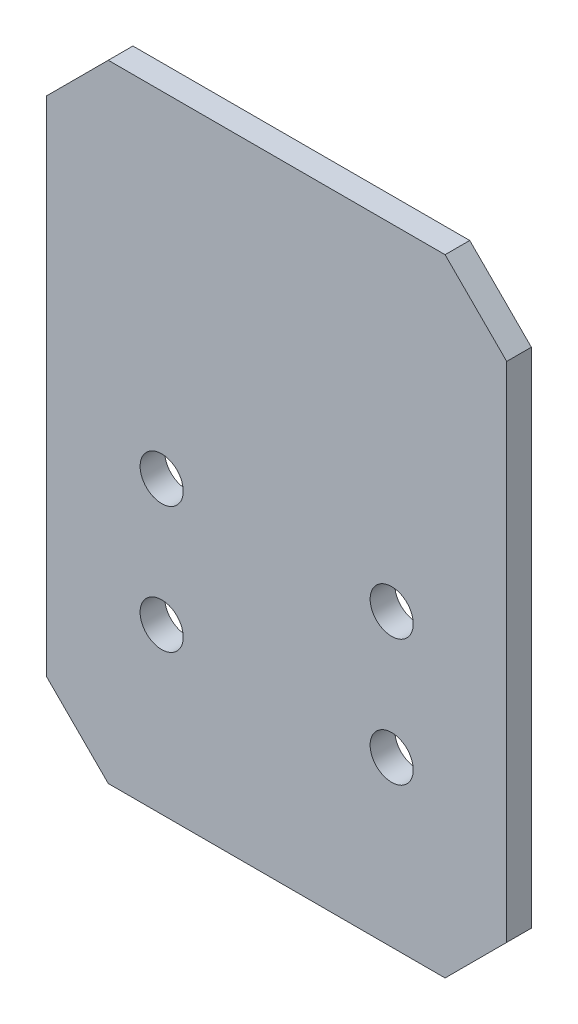
ISO-10303-21;
HEADER;
FILE_DESCRIPTION(('STEP AP214'),'2;1');
FILE_NAME('part.step','',(''),(''),'','','');
FILE_SCHEMA(('AUTOMOTIVE_DESIGN { 1 0 10303 214 1 1 1 1 }'));
ENDSEC;
DATA;
#1=APPLICATION_CONTEXT('core data for automotive mechanical design processes');
#2=APPLICATION_PROTOCOL_DEFINITION('international standard','automotive_design',2000,#1);
#3=PRODUCT_CONTEXT('',#1,'mechanical');
#4=PRODUCT('Part','Part','',(#3));
#5=PRODUCT_RELATED_PRODUCT_CATEGORY('part','',(#4));
#6=PRODUCT_DEFINITION_FORMATION('','',#4);
#7=PRODUCT_DEFINITION_CONTEXT('part definition',#1,'design');
#8=PRODUCT_DEFINITION('design','',#6,#7);
#9=PRODUCT_DEFINITION_SHAPE('','',#8);
#10=(LENGTH_UNIT() NAMED_UNIT(*) SI_UNIT(.MILLI.,.METRE.));
#11=(NAMED_UNIT(*) PLANE_ANGLE_UNIT() SI_UNIT($,.RADIAN.));
#12=(NAMED_UNIT(*) SI_UNIT($,.STERADIAN.) SOLID_ANGLE_UNIT());
#13=UNCERTAINTY_MEASURE_WITH_UNIT(LENGTH_MEASURE(1.E-05),#10,'distance_accuracy_value','');
#14=(GEOMETRIC_REPRESENTATION_CONTEXT(3) GLOBAL_UNCERTAINTY_ASSIGNED_CONTEXT((#13)) GLOBAL_UNIT_ASSIGNED_CONTEXT((#10,
#11,#12)) REPRESENTATION_CONTEXT('',''));
#15=CARTESIAN_POINT('',(0.,0.,0.));
#16=DIRECTION('',(0.,0.,1.));
#17=DIRECTION('',(1.,0.,0.));
#18=AXIS2_PLACEMENT_3D('',#15,#16,#17);
#19=CARTESIAN_POINT('',(40.9999999999995,-132.5,-6.));
#20=DIRECTION('',(0.,-1.,0.));
#21=DIRECTION('',(1.,0.,0.));
#22=AXIS2_PLACEMENT_3D('',#19,#20,#21);
#23=PLANE('',#22);
#24=DIRECTION('',(1.,0.,0.));
#25=VECTOR('',#24,1.);
#26=CARTESIAN_POINT('',(40.9999999999995,-132.5,0.));
#27=LINE('',#26,#25);
#28=CARTESIAN_POINT('',(-40.9999999999994,-132.5,0.));
#29=VERTEX_POINT('',#28);
#30=CARTESIAN_POINT('',(40.9999999999995,-132.5,0.));
#31=VERTEX_POINT('',#30);
#32=EDGE_CURVE('E133',#29,#31,#27,.T.);
#33=ORIENTED_EDGE('',*,*,#32,.F.);
#34=DIRECTION('',(0.,0.,1.));
#35=VECTOR('',#34,1.);
#36=CARTESIAN_POINT('',(-40.9999999999994,-132.5,-6.));
#37=LINE('',#36,#35);
#38=CARTESIAN_POINT('',(-40.9999999999994,-132.5,-6.));
#39=VERTEX_POINT('',#38);
#40=EDGE_CURVE('E11',#39,#29,#37,.T.);
#41=ORIENTED_EDGE('',*,*,#40,.F.);
#42=DIRECTION('',(1.,0.,0.));
#43=VECTOR('',#42,1.);
#44=CARTESIAN_POINT('',(40.9999999999995,-132.5,-6.));
#45=LINE('',#44,#43);
#46=CARTESIAN_POINT('',(40.9999999999995,-132.5,-6.));
#47=VERTEX_POINT('',#46);
#48=EDGE_CURVE('E154',#39,#47,#45,.T.);
#49=ORIENTED_EDGE('',*,*,#48,.T.);
#50=DIRECTION('',(0.,0.,1.));
#51=VECTOR('',#50,1.);
#52=CARTESIAN_POINT('',(40.9999999999995,-132.5,-6.));
#53=LINE('',#52,#51);
#54=EDGE_CURVE('E39',#47,#31,#53,.T.);
#55=ORIENTED_EDGE('',*,*,#54,.T.);
#56=EDGE_LOOP('',(#33,#41,#49,#55));
#57=FACE_BOUND('',#56,.T.);
#58=ADVANCED_FACE('F36',(#57),#23,.T.);
#59=CARTESIAN_POINT('',(-40.9999999999994,-132.5,-6.));
#60=DIRECTION('',(-0.707106781186554,-0.707106781186541,0.));
#61=DIRECTION('',(0.707106781186541,-0.707106781186554,0.));
#62=AXIS2_PLACEMENT_3D('',#59,#60,#61);
#63=PLANE('',#62);
#64=DIRECTION('',(0.707106781186541,-0.707106781186554,0.));
#65=VECTOR('',#64,1.);
#66=CARTESIAN_POINT('',(-40.9999999999994,-132.5,0.));
#67=LINE('',#66,#65);
#68=CARTESIAN_POINT('',(-55.9999999999992,-117.499999999999,0.));
#69=VERTEX_POINT('',#68);
#70=EDGE_CURVE('E152',#69,#29,#67,.T.);
#71=ORIENTED_EDGE('',*,*,#70,.F.);
#72=DIRECTION('',(0.,0.,1.));
#73=VECTOR('',#72,1.);
#74=CARTESIAN_POINT('',(-55.9999999999992,-117.499999999999,-6.));
#75=LINE('',#74,#73);
#76=CARTESIAN_POINT('',(-55.9999999999992,-117.499999999999,-6.));
#77=VERTEX_POINT('',#76);
#78=EDGE_CURVE('E45',#77,#69,#75,.T.);
#79=ORIENTED_EDGE('',*,*,#78,.F.);
#80=DIRECTION('',(0.707106781186541,-0.707106781186554,0.));
#81=VECTOR('',#80,1.);
#82=CARTESIAN_POINT('',(-40.9999999999994,-132.5,-6.));
#83=LINE('',#82,#81);
#84=EDGE_CURVE('E123',#77,#39,#83,.T.);
#85=ORIENTED_EDGE('',*,*,#84,.T.);
#86=ORIENTED_EDGE('',*,*,#40,.T.);
#87=EDGE_LOOP('',(#71,#79,#85,#86));
#88=FACE_BOUND('',#87,.T.);
#89=ADVANCED_FACE('F166',(#88),#63,.T.);
#90=CARTESIAN_POINT('',(-55.9999999999993,5.,-6.));
#91=DIRECTION('',(-1.,0.,0.));
#92=DIRECTION('',(0.,-1.,0.));
#93=AXIS2_PLACEMENT_3D('',#90,#91,#92);
#94=PLANE('',#93);
#95=DIRECTION('',(0.,-1.,0.));
#96=VECTOR('',#95,1.);
#97=CARTESIAN_POINT('',(-55.9999999999993,5.,0.));
#98=LINE('',#97,#96);
#99=CARTESIAN_POINT('',(-55.9999999999993,5.,0.));
#100=VERTEX_POINT('',#99);
#101=EDGE_CURVE('E110',#100,#69,#98,.T.);
#102=ORIENTED_EDGE('',*,*,#101,.F.);
#103=DIRECTION('',(0.,0.,1.));
#104=VECTOR('',#103,1.);
#105=CARTESIAN_POINT('',(-55.9999999999993,5.,-6.));
#106=LINE('',#105,#104);
#107=CARTESIAN_POINT('',(-55.9999999999993,5.,-6.));
#108=VERTEX_POINT('',#107);
#109=EDGE_CURVE('E105',#108,#100,#106,.T.);
#110=ORIENTED_EDGE('',*,*,#109,.F.);
#111=DIRECTION('',(0.,-1.,0.));
#112=VECTOR('',#111,1.);
#113=CARTESIAN_POINT('',(-55.9999999999993,5.,-6.));
#114=LINE('',#113,#112);
#115=EDGE_CURVE('E108',#108,#77,#114,.T.);
#116=ORIENTED_EDGE('',*,*,#115,.T.);
#117=ORIENTED_EDGE('',*,*,#78,.T.);
#118=EDGE_LOOP('',(#102,#110,#116,#117));
#119=FACE_BOUND('',#118,.T.);
#120=ADVANCED_FACE('F107',(#119),#94,.T.);
#121=CARTESIAN_POINT('',(-40.9999999999991,20.,-6.));
#122=DIRECTION('',(-0.707106781186544,0.707106781186551,0.));
#123=DIRECTION('',(-0.707106781186551,-0.707106781186544,0.));
#124=AXIS2_PLACEMENT_3D('',#121,#122,#123);
#125=PLANE('',#124);
#126=DIRECTION('',(-0.707106781186551,-0.707106781186544,0.));
#127=VECTOR('',#126,1.);
#128=CARTESIAN_POINT('',(-40.9999999999991,20.,0.));
#129=LINE('',#128,#127);
#130=CARTESIAN_POINT('',(-40.9999999999991,20.,0.));
#131=VERTEX_POINT('',#130);
#132=EDGE_CURVE('E149',#131,#100,#129,.T.);
#133=ORIENTED_EDGE('',*,*,#132,.F.);
#134=DIRECTION('',(0.,0.,1.));
#135=VECTOR('',#134,1.);
#136=CARTESIAN_POINT('',(-40.9999999999991,20.,-6.));
#137=LINE('',#136,#135);
#138=CARTESIAN_POINT('',(-40.9999999999991,20.,-6.));
#139=VERTEX_POINT('',#138);
#140=EDGE_CURVE('E115',#139,#131,#137,.T.);
#141=ORIENTED_EDGE('',*,*,#140,.F.);
#142=DIRECTION('',(-0.707106781186551,-0.707106781186544,0.));
#143=VECTOR('',#142,1.);
#144=CARTESIAN_POINT('',(-40.9999999999991,20.,-6.));
#145=LINE('',#144,#143);
#146=EDGE_CURVE('E121',#139,#108,#145,.T.);
#147=ORIENTED_EDGE('',*,*,#146,.T.);
#148=ORIENTED_EDGE('',*,*,#109,.T.);
#149=EDGE_LOOP('',(#133,#141,#147,#148));
#150=FACE_BOUND('',#149,.T.);
#151=ADVANCED_FACE('F125',(#150),#125,.T.);
#152=CARTESIAN_POINT('',(40.999999999999,20.,-6.));
#153=DIRECTION('',(0.,1.,0.));
#154=DIRECTION('',(-1.,0.,0.));
#155=AXIS2_PLACEMENT_3D('',#152,#153,#154);
#156=PLANE('',#155);
#157=DIRECTION('',(-1.,0.,0.));
#158=VECTOR('',#157,1.);
#159=CARTESIAN_POINT('',(40.999999999999,20.,0.));
#160=LINE('',#159,#158);
#161=CARTESIAN_POINT('',(40.999999999999,20.,0.));
#162=VERTEX_POINT('',#161);
#163=EDGE_CURVE('E146',#162,#131,#160,.T.);
#164=ORIENTED_EDGE('',*,*,#163,.F.);
#165=DIRECTION('',(0.,0.,1.));
#166=VECTOR('',#165,1.);
#167=CARTESIAN_POINT('',(40.999999999999,20.,-6.));
#168=LINE('',#167,#166);
#169=CARTESIAN_POINT('',(40.999999999999,20.,-6.));
#170=VERTEX_POINT('',#169);
#171=EDGE_CURVE('E158',#170,#162,#168,.T.);
#172=ORIENTED_EDGE('',*,*,#171,.F.);
#173=DIRECTION('',(-1.,0.,0.));
#174=VECTOR('',#173,1.);
#175=CARTESIAN_POINT('',(40.999999999999,20.,-6.));
#176=LINE('',#175,#174);
#177=EDGE_CURVE('E126',#170,#139,#176,.T.);
#178=ORIENTED_EDGE('',*,*,#177,.T.);
#179=ORIENTED_EDGE('',*,*,#140,.T.);
#180=EDGE_LOOP('',(#164,#172,#178,#179));
#181=FACE_BOUND('',#180,.T.);
#182=ADVANCED_FACE('F179',(#181),#156,.T.);
#183=CARTESIAN_POINT('',(55.9999999999991,5.,-6.));
#184=DIRECTION('',(0.707106781186544,0.707106781186551,0.));
#185=DIRECTION('',(-0.707106781186551,0.707106781186544,0.));
#186=AXIS2_PLACEMENT_3D('',#183,#184,#185);
#187=PLANE('',#186);
#188=DIRECTION('',(-0.707106781186551,0.707106781186544,0.));
#189=VECTOR('',#188,1.);
#190=CARTESIAN_POINT('',(55.9999999999991,5.,0.));
#191=LINE('',#190,#189);
#192=CARTESIAN_POINT('',(55.9999999999991,5.,0.));
#193=VERTEX_POINT('',#192);
#194=EDGE_CURVE('E143',#193,#162,#191,.T.);
#195=ORIENTED_EDGE('',*,*,#194,.F.);
#196=DIRECTION('',(0.,0.,1.));
#197=VECTOR('',#196,1.);
#198=CARTESIAN_POINT('',(55.9999999999991,5.,-6.));
#199=LINE('',#198,#197);
#200=CARTESIAN_POINT('',(55.9999999999991,5.,-6.));
#201=VERTEX_POINT('',#200);
#202=EDGE_CURVE('E160',#201,#193,#199,.T.);
#203=ORIENTED_EDGE('',*,*,#202,.F.);
#204=DIRECTION('',(-0.707106781186551,0.707106781186544,0.));
#205=VECTOR('',#204,1.);
#206=CARTESIAN_POINT('',(55.9999999999991,5.,-6.));
#207=LINE('',#206,#205);
#208=EDGE_CURVE('E128',#201,#170,#207,.T.);
#209=ORIENTED_EDGE('',*,*,#208,.T.);
#210=ORIENTED_EDGE('',*,*,#171,.T.);
#211=EDGE_LOOP('',(#195,#203,#209,#210));
#212=FACE_BOUND('',#211,.T.);
#213=ADVANCED_FACE('F182',(#212),#187,.T.);
#214=CARTESIAN_POINT('',(55.9999999999996,-117.5,-6.));
#215=DIRECTION('',(1.,0.,0.));
#216=DIRECTION('',(0.,1.,0.));
#217=AXIS2_PLACEMENT_3D('',#214,#215,#216);
#218=PLANE('',#217);
#219=DIRECTION('',(0.,1.,0.));
#220=VECTOR('',#219,1.);
#221=CARTESIAN_POINT('',(55.9999999999996,-117.5,0.));
#222=LINE('',#221,#220);
#223=CARTESIAN_POINT('',(55.9999999999996,-117.5,0.));
#224=VERTEX_POINT('',#223);
#225=EDGE_CURVE('E140',#224,#193,#222,.T.);
#226=ORIENTED_EDGE('',*,*,#225,.F.);
#227=DIRECTION('',(0.,0.,1.));
#228=VECTOR('',#227,1.);
#229=CARTESIAN_POINT('',(55.9999999999996,-117.5,-6.));
#230=LINE('',#229,#228);
#231=CARTESIAN_POINT('',(55.9999999999996,-117.5,-6.));
#232=VERTEX_POINT('',#231);
#233=EDGE_CURVE('E161',#232,#224,#230,.T.);
#234=ORIENTED_EDGE('',*,*,#233,.F.);
#235=DIRECTION('',(0.,1.,0.));
#236=VECTOR('',#235,1.);
#237=CARTESIAN_POINT('',(55.9999999999996,-117.5,-6.));
#238=LINE('',#237,#236);
#239=EDGE_CURVE('E248',#232,#201,#238,.T.);
#240=ORIENTED_EDGE('',*,*,#239,.T.);
#241=ORIENTED_EDGE('',*,*,#202,.T.);
#242=EDGE_LOOP('',(#226,#234,#240,#241));
#243=FACE_BOUND('',#242,.T.);
#244=ADVANCED_FACE('F186',(#243),#218,.T.);
#245=CARTESIAN_POINT('',(55.9999999999996,-117.5,-6.));
#246=DIRECTION('',(0.707106781186543,-0.707106781186552,0.));
#247=DIRECTION('',(0.707106781186552,0.707106781186543,0.));
#248=AXIS2_PLACEMENT_3D('',#245,#246,#247);
#249=PLANE('',#248);
#250=DIRECTION('',(0.707106781186552,0.707106781186543,0.));
#251=VECTOR('',#250,1.);
#252=CARTESIAN_POINT('',(55.9999999999996,-117.5,0.));
#253=LINE('',#252,#251);
#254=EDGE_CURVE('E136',#31,#224,#253,.T.);
#255=ORIENTED_EDGE('',*,*,#254,.F.);
#256=ORIENTED_EDGE('',*,*,#54,.F.);
#257=DIRECTION('',(0.707106781186552,0.707106781186543,0.));
#258=VECTOR('',#257,1.);
#259=CARTESIAN_POINT('',(55.9999999999996,-117.5,-6.));
#260=LINE('',#259,#258);
#261=EDGE_CURVE('E246',#47,#232,#260,.T.);
#262=ORIENTED_EDGE('',*,*,#261,.T.);
#263=ORIENTED_EDGE('',*,*,#233,.T.);
#264=EDGE_LOOP('',(#255,#256,#262,#263));
#265=FACE_BOUND('',#264,.T.);
#266=ADVANCED_FACE('F163',(#265),#249,.T.);
#267=CARTESIAN_POINT('',(0.,0.,-6.));
#268=DIRECTION('',(0.,0.,1.));
#269=DIRECTION('',(1.,0.,0.));
#270=AXIS2_PLACEMENT_3D('',#267,#268,#269);
#271=PLANE('',#270);
#272=CARTESIAN_POINT('',(-27.9999999999993,-61.7261893195207,-6.));
#273=DIRECTION('',(0.,0.,1.));
#274=DIRECTION('',(1.,0.,0.));
#275=AXIS2_PLACEMENT_3D('',#272,#273,#274);
#276=CIRCLE('',#275,5.25000000000001);
#277=CARTESIAN_POINT('',(-22.7499999999993,-61.7261893195207,-6.));
#278=VERTEX_POINT('',#277);
#279=EDGE_CURVE('E221',#278,#278,#276,.T.);
#280=ORIENTED_EDGE('',*,*,#279,.T.);
#281=EDGE_LOOP('',(#280));
#282=FACE_BOUND('',#281,.T.);
#283=CARTESIAN_POINT('',(-27.9999999999995,-92.4999999999999,-6.));
#284=DIRECTION('',(0.,0.,1.));
#285=DIRECTION('',(1.,0.,0.));
#286=AXIS2_PLACEMENT_3D('',#283,#284,#285);
#287=CIRCLE('',#286,5.25);
#288=CARTESIAN_POINT('',(-22.7499999999995,-92.4999999999999,-6.));
#289=VERTEX_POINT('',#288);
#290=EDGE_CURVE('E229',#289,#289,#287,.T.);
#291=ORIENTED_EDGE('',*,*,#290,.T.);
#292=EDGE_LOOP('',(#291));
#293=FACE_BOUND('',#292,.T.);
#294=CARTESIAN_POINT('',(28.0000000000001,-92.4999999999999,-6.));
#295=DIRECTION('',(0.,0.,1.));
#296=DIRECTION('',(1.,0.,0.));
#297=AXIS2_PLACEMENT_3D('',#294,#295,#296);
#298=CIRCLE('',#297,5.25);
#299=CARTESIAN_POINT('',(33.2500000000001,-92.4999999999999,-6.));
#300=VERTEX_POINT('',#299);
#301=EDGE_CURVE('E235',#300,#300,#298,.T.);
#302=ORIENTED_EDGE('',*,*,#301,.T.);
#303=EDGE_LOOP('',(#302));
#304=FACE_BOUND('',#303,.T.);
#305=CARTESIAN_POINT('',(28.0000000000001,-61.7261893195207,-6.));
#306=DIRECTION('',(0.,0.,1.));
#307=DIRECTION('',(1.,0.,0.));
#308=AXIS2_PLACEMENT_3D('',#305,#306,#307);
#309=CIRCLE('',#308,5.25);
#310=CARTESIAN_POINT('',(33.2500000000001,-61.7261893195207,-6.));
#311=VERTEX_POINT('',#310);
#312=EDGE_CURVE('E137',#311,#311,#309,.T.);
#313=ORIENTED_EDGE('',*,*,#312,.T.);
#314=EDGE_LOOP('',(#313));
#315=FACE_BOUND('',#314,.T.);
#316=ORIENTED_EDGE('',*,*,#48,.F.);
#317=ORIENTED_EDGE('',*,*,#84,.F.);
#318=ORIENTED_EDGE('',*,*,#115,.F.);
#319=ORIENTED_EDGE('',*,*,#146,.F.);
#320=ORIENTED_EDGE('',*,*,#177,.F.);
#321=ORIENTED_EDGE('',*,*,#208,.F.);
#322=ORIENTED_EDGE('',*,*,#239,.F.);
#323=ORIENTED_EDGE('',*,*,#261,.F.);
#324=EDGE_LOOP('',(#316,#317,#318,#319,#320,#321,#322,#323));
#325=FACE_BOUND('',#324,.T.);
#326=ADVANCED_FACE('F119',(#282,#293,#304,#315,#325),#271,.F.);
#327=CARTESIAN_POINT('',(0.,0.,0.));
#328=DIRECTION('',(0.,0.,1.));
#329=DIRECTION('',(1.,0.,0.));
#330=AXIS2_PLACEMENT_3D('',#327,#328,#329);
#331=PLANE('',#330);
#332=CARTESIAN_POINT('',(-27.9999999999993,-61.7261893195207,0.));
#333=DIRECTION('',(0.,0.,1.));
#334=DIRECTION('',(1.,0.,0.));
#335=AXIS2_PLACEMENT_3D('',#332,#333,#334);
#336=CIRCLE('',#335,5.25000000000001);
#337=CARTESIAN_POINT('',(-22.7499999999993,-61.7261893195207,0.));
#338=VERTEX_POINT('',#337);
#339=EDGE_CURVE('E224',#338,#338,#336,.T.);
#340=ORIENTED_EDGE('',*,*,#339,.F.);
#341=EDGE_LOOP('',(#340));
#342=FACE_BOUND('',#341,.T.);
#343=CARTESIAN_POINT('',(-27.9999999999995,-92.4999999999999,0.));
#344=DIRECTION('',(0.,0.,1.));
#345=DIRECTION('',(1.,0.,0.));
#346=AXIS2_PLACEMENT_3D('',#343,#344,#345);
#347=CIRCLE('',#346,5.25);
#348=CARTESIAN_POINT('',(-22.7499999999995,-92.4999999999999,0.));
#349=VERTEX_POINT('',#348);
#350=EDGE_CURVE('E226',#349,#349,#347,.T.);
#351=ORIENTED_EDGE('',*,*,#350,.F.);
#352=EDGE_LOOP('',(#351));
#353=FACE_BOUND('',#352,.T.);
#354=CARTESIAN_POINT('',(28.0000000000001,-92.4999999999999,0.));
#355=DIRECTION('',(0.,0.,1.));
#356=DIRECTION('',(1.,0.,0.));
#357=AXIS2_PLACEMENT_3D('',#354,#355,#356);
#358=CIRCLE('',#357,5.25);
#359=CARTESIAN_POINT('',(33.2500000000001,-92.4999999999999,0.));
#360=VERTEX_POINT('',#359);
#361=EDGE_CURVE('E232',#360,#360,#358,.T.);
#362=ORIENTED_EDGE('',*,*,#361,.F.);
#363=EDGE_LOOP('',(#362));
#364=FACE_BOUND('',#363,.T.);
#365=CARTESIAN_POINT('',(28.0000000000001,-61.7261893195207,0.));
#366=DIRECTION('',(0.,0.,1.));
#367=DIRECTION('',(1.,0.,0.));
#368=AXIS2_PLACEMENT_3D('',#365,#366,#367);
#369=CIRCLE('',#368,5.25);
#370=CARTESIAN_POINT('',(33.2500000000001,-61.7261893195207,0.));
#371=VERTEX_POINT('',#370);
#372=EDGE_CURVE('E238',#371,#371,#369,.T.);
#373=ORIENTED_EDGE('',*,*,#372,.F.);
#374=EDGE_LOOP('',(#373));
#375=FACE_BOUND('',#374,.T.);
#376=ORIENTED_EDGE('',*,*,#32,.T.);
#377=ORIENTED_EDGE('',*,*,#254,.T.);
#378=ORIENTED_EDGE('',*,*,#225,.T.);
#379=ORIENTED_EDGE('',*,*,#194,.T.);
#380=ORIENTED_EDGE('',*,*,#163,.T.);
#381=ORIENTED_EDGE('',*,*,#132,.T.);
#382=ORIENTED_EDGE('',*,*,#101,.T.);
#383=ORIENTED_EDGE('',*,*,#70,.T.);
#384=EDGE_LOOP('',(#376,#377,#378,#379,#380,#381,#382,#383));
#385=FACE_BOUND('',#384,.T.);
#386=ADVANCED_FACE('F165',(#342,#353,#364,#375,#385),#331,.T.);
#387=CARTESIAN_POINT('',(28.0000000000001,-61.7261893195207,-6.));
#388=DIRECTION('',(0.,0.,1.));
#389=DIRECTION('',(1.,0.,0.));
#390=AXIS2_PLACEMENT_3D('',#387,#388,#389);
#391=CYLINDRICAL_SURFACE('',#390,5.25);
#392=ORIENTED_EDGE('',*,*,#312,.F.);
#393=EDGE_LOOP('',(#392));
#394=FACE_BOUND('',#393,.T.);
#395=ORIENTED_EDGE('',*,*,#372,.T.);
#396=EDGE_LOOP('',(#395));
#397=FACE_BOUND('',#396,.T.);
#398=ADVANCED_FACE('F198',(#394,#397),#391,.F.);
#399=CARTESIAN_POINT('',(28.0000000000001,-92.4999999999999,-6.));
#400=DIRECTION('',(0.,0.,1.));
#401=DIRECTION('',(1.,0.,0.));
#402=AXIS2_PLACEMENT_3D('',#399,#400,#401);
#403=CYLINDRICAL_SURFACE('',#402,5.25);
#404=ORIENTED_EDGE('',*,*,#301,.F.);
#405=EDGE_LOOP('',(#404));
#406=FACE_BOUND('',#405,.T.);
#407=ORIENTED_EDGE('',*,*,#361,.T.);
#408=EDGE_LOOP('',(#407));
#409=FACE_BOUND('',#408,.T.);
#410=ADVANCED_FACE('F205',(#406,#409),#403,.F.);
#411=CARTESIAN_POINT('',(-27.9999999999995,-92.4999999999999,-6.));
#412=DIRECTION('',(0.,0.,1.));
#413=DIRECTION('',(1.,0.,0.));
#414=AXIS2_PLACEMENT_3D('',#411,#412,#413);
#415=CYLINDRICAL_SURFACE('',#414,5.25);
#416=ORIENTED_EDGE('',*,*,#290,.F.);
#417=EDGE_LOOP('',(#416));
#418=FACE_BOUND('',#417,.T.);
#419=ORIENTED_EDGE('',*,*,#350,.T.);
#420=EDGE_LOOP('',(#419));
#421=FACE_BOUND('',#420,.T.);
#422=ADVANCED_FACE('F209',(#418,#421),#415,.F.);
#423=CARTESIAN_POINT('',(-27.9999999999993,-61.7261893195207,-6.));
#424=DIRECTION('',(0.,0.,1.));
#425=DIRECTION('',(1.,0.,0.));
#426=AXIS2_PLACEMENT_3D('',#423,#424,#425);
#427=CYLINDRICAL_SURFACE('',#426,5.25000000000001);
#428=ORIENTED_EDGE('',*,*,#279,.F.);
#429=EDGE_LOOP('',(#428));
#430=FACE_BOUND('',#429,.T.);
#431=ORIENTED_EDGE('',*,*,#339,.T.);
#432=EDGE_LOOP('',(#431));
#433=FACE_BOUND('',#432,.T.);
#434=ADVANCED_FACE('F213',(#430,#433),#427,.F.);
#435=CLOSED_SHELL('',(#58,#89,#120,#151,#182,#213,#244,#266,#326,#386,#398,#410,#422,#434));
#436=MANIFOLD_SOLID_BREP('B2',#435);
#437=ADVANCED_BREP_SHAPE_REPRESENTATION('',(#18,#436),#14);
#438=SHAPE_DEFINITION_REPRESENTATION(#9,#437);
ENDSEC;
END-ISO-10303-21;
